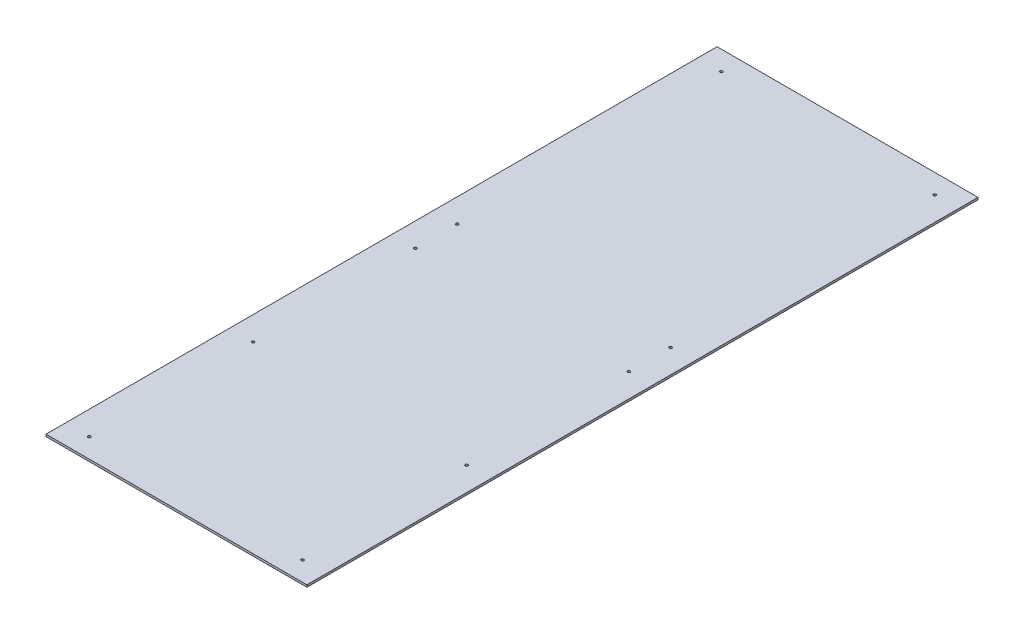
ISO-10303-21;
HEADER;
FILE_DESCRIPTION(('STEP AP214'),'2;1');
FILE_NAME('part.step','',(''),(''),'','','');
FILE_SCHEMA(('AUTOMOTIVE_DESIGN { 1 0 10303 214 1 1 1 1 }'));
ENDSEC;
DATA;
#1=APPLICATION_CONTEXT('core data for automotive mechanical design processes');
#2=APPLICATION_PROTOCOL_DEFINITION('international standard','automotive_design',2000,#1);
#3=PRODUCT_CONTEXT('',#1,'mechanical');
#4=PRODUCT('Part','Part','',(#3));
#5=PRODUCT_RELATED_PRODUCT_CATEGORY('part','',(#4));
#6=PRODUCT_DEFINITION_FORMATION('','',#4);
#7=PRODUCT_DEFINITION_CONTEXT('part definition',#1,'design');
#8=PRODUCT_DEFINITION('design','',#6,#7);
#9=PRODUCT_DEFINITION_SHAPE('','',#8);
#10=(LENGTH_UNIT() NAMED_UNIT(*) SI_UNIT(.MILLI.,.METRE.));
#11=(NAMED_UNIT(*) PLANE_ANGLE_UNIT() SI_UNIT($,.RADIAN.));
#12=(NAMED_UNIT(*) SI_UNIT($,.STERADIAN.) SOLID_ANGLE_UNIT());
#13=UNCERTAINTY_MEASURE_WITH_UNIT(LENGTH_MEASURE(1.E-05),#10,'distance_accuracy_value','');
#14=(GEOMETRIC_REPRESENTATION_CONTEXT(3) GLOBAL_UNCERTAINTY_ASSIGNED_CONTEXT((#13)) GLOBAL_UNIT_ASSIGNED_CONTEXT((#10,
#11,#12)) REPRESENTATION_CONTEXT('',''));
#15=CARTESIAN_POINT('',(0.,0.,0.));
#16=DIRECTION('',(0.,0.,1.));
#17=DIRECTION('',(1.,0.,0.));
#18=AXIS2_PLACEMENT_3D('',#15,#16,#17);
#19=CARTESIAN_POINT('',(-383.921,6.35,987.425));
#20=DIRECTION('',(1.,0.,0.));
#21=DIRECTION('',(0.,0.,-1.));
#22=AXIS2_PLACEMENT_3D('',#19,#20,#21);
#23=PLANE('',#22);
#24=DIRECTION('',(0.,0.,1.));
#25=VECTOR('',#24,1.);
#26=CARTESIAN_POINT('',(-383.921,0.,987.425));
#27=LINE('',#26,#25);
#28=CARTESIAN_POINT('',(-383.921,0.,-987.425));
#29=VERTEX_POINT('',#28);
#30=CARTESIAN_POINT('',(-383.921,0.,987.425));
#31=VERTEX_POINT('',#30);
#32=EDGE_CURVE('E97',#29,#31,#27,.T.);
#33=ORIENTED_EDGE('',*,*,#32,.T.);
#34=DIRECTION('',(0.,-1.,0.));
#35=VECTOR('',#34,1.);
#36=CARTESIAN_POINT('',(-383.921,6.35,987.425));
#37=LINE('',#36,#35);
#38=CARTESIAN_POINT('',(-383.921,6.35,987.425));
#39=VERTEX_POINT('',#38);
#40=EDGE_CURVE('E11',#39,#31,#37,.T.);
#41=ORIENTED_EDGE('',*,*,#40,.F.);
#42=DIRECTION('',(0.,0.,1.));
#43=VECTOR('',#42,1.);
#44=CARTESIAN_POINT('',(-383.921,6.35,987.425));
#45=LINE('',#44,#43);
#46=CARTESIAN_POINT('',(-383.921,6.35,-987.425));
#47=VERTEX_POINT('',#46);
#48=EDGE_CURVE('E85',#47,#39,#45,.T.);
#49=ORIENTED_EDGE('',*,*,#48,.F.);
#50=DIRECTION('',(0.,-1.,0.));
#51=VECTOR('',#50,1.);
#52=CARTESIAN_POINT('',(-383.921,6.35,-987.425));
#53=LINE('',#52,#51);
#54=EDGE_CURVE('E93',#47,#29,#53,.T.);
#55=ORIENTED_EDGE('',*,*,#54,.T.);
#56=EDGE_LOOP('',(#33,#41,#49,#55));
#57=FACE_BOUND('',#56,.T.);
#58=ADVANCED_FACE('F34',(#57),#23,.F.);
#59=CARTESIAN_POINT('',(383.921,6.35,987.425));
#60=DIRECTION('',(0.,0.,-1.));
#61=DIRECTION('',(-1.,0.,0.));
#62=AXIS2_PLACEMENT_3D('',#59,#60,#61);
#63=PLANE('',#62);
#64=DIRECTION('',(1.,0.,0.));
#65=VECTOR('',#64,1.);
#66=CARTESIAN_POINT('',(383.921,0.,987.425));
#67=LINE('',#66,#65);
#68=CARTESIAN_POINT('',(383.921,0.,987.425));
#69=VERTEX_POINT('',#68);
#70=EDGE_CURVE('E89',#31,#69,#67,.T.);
#71=ORIENTED_EDGE('',*,*,#70,.T.);
#72=DIRECTION('',(0.,-1.,0.));
#73=VECTOR('',#72,1.);
#74=CARTESIAN_POINT('',(383.921,6.35,987.425));
#75=LINE('',#74,#73);
#76=CARTESIAN_POINT('',(383.921,6.35,987.425));
#77=VERTEX_POINT('',#76);
#78=EDGE_CURVE('E42',#77,#69,#75,.T.);
#79=ORIENTED_EDGE('',*,*,#78,.F.);
#80=DIRECTION('',(1.,0.,0.));
#81=VECTOR('',#80,1.);
#82=CARTESIAN_POINT('',(383.921,6.35,987.425));
#83=LINE('',#82,#81);
#84=EDGE_CURVE('E80',#39,#77,#83,.T.);
#85=ORIENTED_EDGE('',*,*,#84,.F.);
#86=ORIENTED_EDGE('',*,*,#40,.T.);
#87=EDGE_LOOP('',(#71,#79,#85,#86));
#88=FACE_BOUND('',#87,.T.);
#89=ADVANCED_FACE('F88',(#88),#63,.F.);
#90=CARTESIAN_POINT('',(383.921,6.35,987.425));
#91=DIRECTION('',(-1.,0.,0.));
#92=DIRECTION('',(0.,0.,1.));
#93=AXIS2_PLACEMENT_3D('',#90,#91,#92);
#94=PLANE('',#93);
#95=DIRECTION('',(0.,0.,-1.));
#96=VECTOR('',#95,1.);
#97=CARTESIAN_POINT('',(383.921,0.,987.425));
#98=LINE('',#97,#96);
#99=CARTESIAN_POINT('',(383.921,0.,-987.425));
#100=VERTEX_POINT('',#99);
#101=EDGE_CURVE('E67',#69,#100,#98,.T.);
#102=ORIENTED_EDGE('',*,*,#101,.T.);
#103=DIRECTION('',(0.,-1.,0.));
#104=VECTOR('',#103,1.);
#105=CARTESIAN_POINT('',(383.921,6.35,-987.425));
#106=LINE('',#105,#104);
#107=CARTESIAN_POINT('',(383.921,6.35,-987.425));
#108=VERTEX_POINT('',#107);
#109=EDGE_CURVE('E90',#108,#100,#106,.T.);
#110=ORIENTED_EDGE('',*,*,#109,.F.);
#111=DIRECTION('',(0.,0.,-1.));
#112=VECTOR('',#111,1.);
#113=CARTESIAN_POINT('',(383.921,6.35,987.425));
#114=LINE('',#113,#112);
#115=EDGE_CURVE('E83',#77,#108,#114,.T.);
#116=ORIENTED_EDGE('',*,*,#115,.F.);
#117=ORIENTED_EDGE('',*,*,#78,.T.);
#118=EDGE_LOOP('',(#102,#110,#116,#117));
#119=FACE_BOUND('',#118,.T.);
#120=ADVANCED_FACE('F91',(#119),#94,.F.);
#121=CARTESIAN_POINT('',(383.921,6.35,-987.425));
#122=DIRECTION('',(0.,0.,1.));
#123=DIRECTION('',(1.,0.,0.));
#124=AXIS2_PLACEMENT_3D('',#121,#122,#123);
#125=PLANE('',#124);
#126=DIRECTION('',(-1.,0.,0.));
#127=VECTOR('',#126,1.);
#128=CARTESIAN_POINT('',(383.921,0.,-987.425));
#129=LINE('',#128,#127);
#130=EDGE_CURVE('E73',#100,#29,#129,.T.);
#131=ORIENTED_EDGE('',*,*,#130,.T.);
#132=ORIENTED_EDGE('',*,*,#54,.F.);
#133=DIRECTION('',(-1.,0.,0.));
#134=VECTOR('',#133,1.);
#135=CARTESIAN_POINT('',(383.921,6.35,-987.425));
#136=LINE('',#135,#134);
#137=EDGE_CURVE('E50',#108,#47,#136,.T.);
#138=ORIENTED_EDGE('',*,*,#137,.F.);
#139=ORIENTED_EDGE('',*,*,#109,.T.);
#140=EDGE_LOOP('',(#131,#132,#138,#139));
#141=FACE_BOUND('',#140,.T.);
#142=ADVANCED_FACE('F105',(#141),#125,.F.);
#143=CARTESIAN_POINT('',(0.,6.35,0.));
#144=DIRECTION('',(0.,1.,0.));
#145=DIRECTION('',(0.,0.,1.));
#146=AXIS2_PLACEMENT_3D('',#143,#144,#145);
#147=PLANE('',#146);
#148=CARTESIAN_POINT('',(314.070999999993,6.35,930.275));
#149=DIRECTION('',(0.,-1.,0.));
#150=DIRECTION('',(0.,0.,-1.));
#151=AXIS2_PLACEMENT_3D('',#148,#149,#150);
#152=CIRCLE('',#151,4.01319999999999);
#153=CARTESIAN_POINT('',(314.070999999993,6.35,926.2618));
#154=VERTEX_POINT('',#153);
#155=EDGE_CURVE('E164',#154,#154,#152,.T.);
#156=ORIENTED_EDGE('',*,*,#155,.T.);
#157=EDGE_LOOP('',(#156));
#158=FACE_BOUND('',#157,.T.);
#159=CARTESIAN_POINT('',(-313.944000000007,6.35,930.275));
#160=DIRECTION('',(0.,-1.,0.));
#161=DIRECTION('',(0.,0.,-1.));
#162=AXIS2_PLACEMENT_3D('',#159,#160,#161);
#163=CIRCLE('',#162,4.01319999999999);
#164=CARTESIAN_POINT('',(-313.944000000007,6.35,926.2618));
#165=VERTEX_POINT('',#164);
#166=EDGE_CURVE('E158',#165,#165,#163,.T.);
#167=ORIENTED_EDGE('',*,*,#166,.T.);
#168=EDGE_LOOP('',(#167));
#169=FACE_BOUND('',#168,.T.);
#170=CARTESIAN_POINT('',(314.070999999996,6.35,-29.6337387767919));
#171=DIRECTION('',(0.,-1.,0.));
#172=DIRECTION('',(0.,0.,-1.));
#173=AXIS2_PLACEMENT_3D('',#170,#171,#172);
#174=CIRCLE('',#173,4.01319999999999);
#175=CARTESIAN_POINT('',(314.070999999996,6.35,-33.6469387767919));
#176=VERTEX_POINT('',#175);
#177=EDGE_CURVE('E152',#176,#176,#174,.T.);
#178=ORIENTED_EDGE('',*,*,#177,.T.);
#179=EDGE_LOOP('',(#178));
#180=FACE_BOUND('',#179,.T.);
#181=CARTESIAN_POINT('',(-314.071,6.35,-29.6337387767919));
#182=DIRECTION('',(0.,-1.,0.));
#183=DIRECTION('',(0.,0.,-1.));
#184=AXIS2_PLACEMENT_3D('',#181,#182,#183);
#185=CIRCLE('',#184,4.01319999999999);
#186=CARTESIAN_POINT('',(-314.071,6.35,-33.6469387767919));
#187=VERTEX_POINT('',#186);
#188=EDGE_CURVE('E146',#187,#187,#185,.T.);
#189=ORIENTED_EDGE('',*,*,#188,.T.);
#190=EDGE_LOOP('',(#189));
#191=FACE_BOUND('',#190,.T.);
#192=CARTESIAN_POINT('',(-313.944,6.35,-930.275));
#193=DIRECTION('',(0.,-1.,0.));
#194=DIRECTION('',(0.,0.,-1.));
#195=AXIS2_PLACEMENT_3D('',#192,#193,#194);
#196=CIRCLE('',#195,4.01319999999999);
#197=CARTESIAN_POINT('',(-313.944,6.35,-934.2882));
#198=VERTEX_POINT('',#197);
#199=EDGE_CURVE('E140',#198,#198,#196,.T.);
#200=ORIENTED_EDGE('',*,*,#199,.T.);
#201=EDGE_LOOP('',(#200));
#202=FACE_BOUND('',#201,.T.);
#203=CARTESIAN_POINT('',(314.071,6.35,-930.275));
#204=DIRECTION('',(0.,-1.,0.));
#205=DIRECTION('',(0.,0.,-1.));
#206=AXIS2_PLACEMENT_3D('',#203,#204,#205);
#207=CIRCLE('',#206,4.01319999999999);
#208=CARTESIAN_POINT('',(314.071,6.35,-934.2882));
#209=VERTEX_POINT('',#208);
#210=EDGE_CURVE('E134',#209,#209,#207,.T.);
#211=ORIENTED_EDGE('',*,*,#210,.T.);
#212=EDGE_LOOP('',(#211));
#213=FACE_BOUND('',#212,.T.);
#214=CARTESIAN_POINT('',(314.071,6.35,-152.769407651758));
#215=DIRECTION('',(0.,-1.,0.));
#216=DIRECTION('',(0.,0.,-1.));
#217=AXIS2_PLACEMENT_3D('',#214,#215,#216);
#218=CIRCLE('',#217,4.01319999999999);
#219=CARTESIAN_POINT('',(314.071,6.35,-156.782607651758));
#220=VERTEX_POINT('',#219);
#221=EDGE_CURVE('E128',#220,#220,#218,.T.);
#222=ORIENTED_EDGE('',*,*,#221,.T.);
#223=EDGE_LOOP('',(#222));
#224=FACE_BOUND('',#223,.T.);
#225=CARTESIAN_POINT('',(-314.070999999996,6.35,-152.769407651758));
#226=DIRECTION('',(0.,-1.,0.));
#227=DIRECTION('',(0.,0.,-1.));
#228=AXIS2_PLACEMENT_3D('',#225,#226,#227);
#229=CIRCLE('',#228,4.01319999999999);
#230=CARTESIAN_POINT('',(-314.070999999996,6.35,-156.782607651758));
#231=VERTEX_POINT('',#230);
#232=EDGE_CURVE('E122',#231,#231,#229,.T.);
#233=ORIENTED_EDGE('',*,*,#232,.T.);
#234=EDGE_LOOP('',(#233));
#235=FACE_BOUND('',#234,.T.);
#236=CARTESIAN_POINT('',(314.070999999993,6.35,447.611159484925));
#237=DIRECTION('',(0.,-1.,0.));
#238=DIRECTION('',(0.,0.,-1.));
#239=AXIS2_PLACEMENT_3D('',#236,#237,#238);
#240=CIRCLE('',#239,4.01319999999999);
#241=CARTESIAN_POINT('',(314.070999999993,6.35,443.597959484925));
#242=VERTEX_POINT('',#241);
#243=EDGE_CURVE('E116',#242,#242,#240,.T.);
#244=ORIENTED_EDGE('',*,*,#243,.T.);
#245=EDGE_LOOP('',(#244));
#246=FACE_BOUND('',#245,.T.);
#247=CARTESIAN_POINT('',(-314.071,6.35,447.611159484925));
#248=DIRECTION('',(0.,-1.,0.));
#249=DIRECTION('',(0.,0.,-1.));
#250=AXIS2_PLACEMENT_3D('',#247,#248,#249);
#251=CIRCLE('',#250,4.01319999999999);
#252=CARTESIAN_POINT('',(-314.071,6.35,443.597959484925));
#253=VERTEX_POINT('',#252);
#254=EDGE_CURVE('E100',#253,#253,#251,.T.);
#255=ORIENTED_EDGE('',*,*,#254,.T.);
#256=EDGE_LOOP('',(#255));
#257=FACE_BOUND('',#256,.T.);
#258=ORIENTED_EDGE('',*,*,#48,.T.);
#259=ORIENTED_EDGE('',*,*,#84,.T.);
#260=ORIENTED_EDGE('',*,*,#115,.T.);
#261=ORIENTED_EDGE('',*,*,#137,.T.);
#262=EDGE_LOOP('',(#258,#259,#260,#261));
#263=FACE_BOUND('',#262,.T.);
#264=ADVANCED_FACE('F81',(#158,#169,#180,#191,#202,#213,#224,#235,#246,#257,#263),#147,.T.);
#265=CARTESIAN_POINT('',(0.,0.,0.));
#266=DIRECTION('',(0.,1.,0.));
#267=DIRECTION('',(0.,0.,1.));
#268=AXIS2_PLACEMENT_3D('',#265,#266,#267);
#269=PLANE('',#268);
#270=CARTESIAN_POINT('',(314.070999999993,0.,930.275));
#271=DIRECTION('',(0.,-1.,0.));
#272=DIRECTION('',(0.,0.,-1.));
#273=AXIS2_PLACEMENT_3D('',#270,#271,#272);
#274=CIRCLE('',#273,4.01319999999999);
#275=CARTESIAN_POINT('',(314.070999999993,0.,926.2618));
#276=VERTEX_POINT('',#275);
#277=EDGE_CURVE('E167',#276,#276,#274,.T.);
#278=ORIENTED_EDGE('',*,*,#277,.F.);
#279=EDGE_LOOP('',(#278));
#280=FACE_BOUND('',#279,.T.);
#281=CARTESIAN_POINT('',(-313.944000000007,0.,930.275));
#282=DIRECTION('',(0.,-1.,0.));
#283=DIRECTION('',(0.,0.,-1.));
#284=AXIS2_PLACEMENT_3D('',#281,#282,#283);
#285=CIRCLE('',#284,4.01319999999999);
#286=CARTESIAN_POINT('',(-313.944000000007,0.,926.2618));
#287=VERTEX_POINT('',#286);
#288=EDGE_CURVE('E161',#287,#287,#285,.T.);
#289=ORIENTED_EDGE('',*,*,#288,.F.);
#290=EDGE_LOOP('',(#289));
#291=FACE_BOUND('',#290,.T.);
#292=CARTESIAN_POINT('',(314.070999999996,0.,-29.6337387767919));
#293=DIRECTION('',(0.,-1.,0.));
#294=DIRECTION('',(0.,0.,-1.));
#295=AXIS2_PLACEMENT_3D('',#292,#293,#294);
#296=CIRCLE('',#295,4.01319999999999);
#297=CARTESIAN_POINT('',(314.070999999996,0.,-33.6469387767919));
#298=VERTEX_POINT('',#297);
#299=EDGE_CURVE('E155',#298,#298,#296,.T.);
#300=ORIENTED_EDGE('',*,*,#299,.F.);
#301=EDGE_LOOP('',(#300));
#302=FACE_BOUND('',#301,.T.);
#303=CARTESIAN_POINT('',(-314.071,0.,-29.6337387767919));
#304=DIRECTION('',(0.,-1.,0.));
#305=DIRECTION('',(0.,0.,-1.));
#306=AXIS2_PLACEMENT_3D('',#303,#304,#305);
#307=CIRCLE('',#306,4.01319999999999);
#308=CARTESIAN_POINT('',(-314.071,0.,-33.6469387767919));
#309=VERTEX_POINT('',#308);
#310=EDGE_CURVE('E149',#309,#309,#307,.T.);
#311=ORIENTED_EDGE('',*,*,#310,.F.);
#312=EDGE_LOOP('',(#311));
#313=FACE_BOUND('',#312,.T.);
#314=CARTESIAN_POINT('',(-313.944,0.,-930.275));
#315=DIRECTION('',(0.,-1.,0.));
#316=DIRECTION('',(0.,0.,-1.));
#317=AXIS2_PLACEMENT_3D('',#314,#315,#316);
#318=CIRCLE('',#317,4.01319999999999);
#319=CARTESIAN_POINT('',(-313.944,0.,-934.2882));
#320=VERTEX_POINT('',#319);
#321=EDGE_CURVE('E143',#320,#320,#318,.T.);
#322=ORIENTED_EDGE('',*,*,#321,.F.);
#323=EDGE_LOOP('',(#322));
#324=FACE_BOUND('',#323,.T.);
#325=CARTESIAN_POINT('',(314.071,0.,-930.275));
#326=DIRECTION('',(0.,-1.,0.));
#327=DIRECTION('',(0.,0.,-1.));
#328=AXIS2_PLACEMENT_3D('',#325,#326,#327);
#329=CIRCLE('',#328,4.01319999999999);
#330=CARTESIAN_POINT('',(314.071,0.,-934.2882));
#331=VERTEX_POINT('',#330);
#332=EDGE_CURVE('E137',#331,#331,#329,.T.);
#333=ORIENTED_EDGE('',*,*,#332,.F.);
#334=EDGE_LOOP('',(#333));
#335=FACE_BOUND('',#334,.T.);
#336=CARTESIAN_POINT('',(314.071,0.,-152.769407651758));
#337=DIRECTION('',(0.,-1.,0.));
#338=DIRECTION('',(0.,0.,-1.));
#339=AXIS2_PLACEMENT_3D('',#336,#337,#338);
#340=CIRCLE('',#339,4.01319999999999);
#341=CARTESIAN_POINT('',(314.071,0.,-156.782607651758));
#342=VERTEX_POINT('',#341);
#343=EDGE_CURVE('E131',#342,#342,#340,.T.);
#344=ORIENTED_EDGE('',*,*,#343,.F.);
#345=EDGE_LOOP('',(#344));
#346=FACE_BOUND('',#345,.T.);
#347=CARTESIAN_POINT('',(-314.070999999996,0.,-152.769407651758));
#348=DIRECTION('',(0.,-1.,0.));
#349=DIRECTION('',(0.,0.,-1.));
#350=AXIS2_PLACEMENT_3D('',#347,#348,#349);
#351=CIRCLE('',#350,4.01319999999999);
#352=CARTESIAN_POINT('',(-314.070999999996,0.,-156.782607651758));
#353=VERTEX_POINT('',#352);
#354=EDGE_CURVE('E125',#353,#353,#351,.T.);
#355=ORIENTED_EDGE('',*,*,#354,.F.);
#356=EDGE_LOOP('',(#355));
#357=FACE_BOUND('',#356,.T.);
#358=CARTESIAN_POINT('',(314.070999999993,0.,447.611159484925));
#359=DIRECTION('',(0.,-1.,0.));
#360=DIRECTION('',(0.,0.,-1.));
#361=AXIS2_PLACEMENT_3D('',#358,#359,#360);
#362=CIRCLE('',#361,4.01319999999999);
#363=CARTESIAN_POINT('',(314.070999999993,0.,443.597959484925));
#364=VERTEX_POINT('',#363);
#365=EDGE_CURVE('E119',#364,#364,#362,.T.);
#366=ORIENTED_EDGE('',*,*,#365,.F.);
#367=EDGE_LOOP('',(#366));
#368=FACE_BOUND('',#367,.T.);
#369=CARTESIAN_POINT('',(-314.071,0.,447.611159484925));
#370=DIRECTION('',(0.,-1.,0.));
#371=DIRECTION('',(0.,0.,-1.));
#372=AXIS2_PLACEMENT_3D('',#369,#370,#371);
#373=CIRCLE('',#372,4.01319999999999);
#374=CARTESIAN_POINT('',(-314.071,0.,443.597959484925));
#375=VERTEX_POINT('',#374);
#376=EDGE_CURVE('E113',#375,#375,#373,.T.);
#377=ORIENTED_EDGE('',*,*,#376,.F.);
#378=EDGE_LOOP('',(#377));
#379=FACE_BOUND('',#378,.T.);
#380=ORIENTED_EDGE('',*,*,#32,.F.);
#381=ORIENTED_EDGE('',*,*,#130,.F.);
#382=ORIENTED_EDGE('',*,*,#101,.F.);
#383=ORIENTED_EDGE('',*,*,#70,.F.);
#384=EDGE_LOOP('',(#380,#381,#382,#383));
#385=FACE_BOUND('',#384,.T.);
#386=ADVANCED_FACE('F108',(#280,#291,#302,#313,#324,#335,#346,#357,#368,#379,#385),#269,.F.);
#387=CARTESIAN_POINT('',(-314.071,0.,447.611159484925));
#388=DIRECTION('',(0.,-1.,0.));
#389=DIRECTION('',(0.,0.,-1.));
#390=AXIS2_PLACEMENT_3D('',#387,#388,#389);
#391=CYLINDRICAL_SURFACE('',#390,4.01319999999999);
#392=ORIENTED_EDGE('',*,*,#254,.F.);
#393=EDGE_LOOP('',(#392));
#394=FACE_BOUND('',#393,.T.);
#395=ORIENTED_EDGE('',*,*,#376,.T.);
#396=EDGE_LOOP('',(#395));
#397=FACE_BOUND('',#396,.T.);
#398=ADVANCED_FACE('F175',(#394,#397),#391,.F.);
#399=CARTESIAN_POINT('',(314.070999999993,0.,447.611159484925));
#400=DIRECTION('',(0.,-1.,0.));
#401=DIRECTION('',(0.,0.,-1.));
#402=AXIS2_PLACEMENT_3D('',#399,#400,#401);
#403=CYLINDRICAL_SURFACE('',#402,4.01319999999999);
#404=ORIENTED_EDGE('',*,*,#243,.F.);
#405=EDGE_LOOP('',(#404));
#406=FACE_BOUND('',#405,.T.);
#407=ORIENTED_EDGE('',*,*,#365,.T.);
#408=EDGE_LOOP('',(#407));
#409=FACE_BOUND('',#408,.T.);
#410=ADVANCED_FACE('F196',(#406,#409),#403,.F.);
#411=CARTESIAN_POINT('',(-314.070999999996,0.,-152.769407651758));
#412=DIRECTION('',(0.,-1.,0.));
#413=DIRECTION('',(0.,0.,-1.));
#414=AXIS2_PLACEMENT_3D('',#411,#412,#413);
#415=CYLINDRICAL_SURFACE('',#414,4.01319999999999);
#416=ORIENTED_EDGE('',*,*,#232,.F.);
#417=EDGE_LOOP('',(#416));
#418=FACE_BOUND('',#417,.T.);
#419=ORIENTED_EDGE('',*,*,#354,.T.);
#420=EDGE_LOOP('',(#419));
#421=FACE_BOUND('',#420,.T.);
#422=ADVANCED_FACE('F202',(#418,#421),#415,.F.);
#423=CARTESIAN_POINT('',(314.071,0.,-152.769407651758));
#424=DIRECTION('',(0.,-1.,0.));
#425=DIRECTION('',(0.,0.,-1.));
#426=AXIS2_PLACEMENT_3D('',#423,#424,#425);
#427=CYLINDRICAL_SURFACE('',#426,4.01319999999999);
#428=ORIENTED_EDGE('',*,*,#221,.F.);
#429=EDGE_LOOP('',(#428));
#430=FACE_BOUND('',#429,.T.);
#431=ORIENTED_EDGE('',*,*,#343,.T.);
#432=EDGE_LOOP('',(#431));
#433=FACE_BOUND('',#432,.T.);
#434=ADVANCED_FACE('F243',(#430,#433),#427,.F.);
#435=CARTESIAN_POINT('',(314.071,0.,-930.275));
#436=DIRECTION('',(0.,-1.,0.));
#437=DIRECTION('',(0.,0.,-1.));
#438=AXIS2_PLACEMENT_3D('',#435,#436,#437);
#439=CYLINDRICAL_SURFACE('',#438,4.01319999999999);
#440=ORIENTED_EDGE('',*,*,#210,.F.);
#441=EDGE_LOOP('',(#440));
#442=FACE_BOUND('',#441,.T.);
#443=ORIENTED_EDGE('',*,*,#332,.T.);
#444=EDGE_LOOP('',(#443));
#445=FACE_BOUND('',#444,.T.);
#446=ADVANCED_FACE('F248',(#442,#445),#439,.F.);
#447=CARTESIAN_POINT('',(-313.944,0.,-930.275));
#448=DIRECTION('',(0.,-1.,0.));
#449=DIRECTION('',(0.,0.,-1.));
#450=AXIS2_PLACEMENT_3D('',#447,#448,#449);
#451=CYLINDRICAL_SURFACE('',#450,4.01319999999999);
#452=ORIENTED_EDGE('',*,*,#199,.F.);
#453=EDGE_LOOP('',(#452));
#454=FACE_BOUND('',#453,.T.);
#455=ORIENTED_EDGE('',*,*,#321,.T.);
#456=EDGE_LOOP('',(#455));
#457=FACE_BOUND('',#456,.T.);
#458=ADVANCED_FACE('F254',(#454,#457),#451,.F.);
#459=CARTESIAN_POINT('',(-314.071,0.,-29.6337387767919));
#460=DIRECTION('',(0.,-1.,0.));
#461=DIRECTION('',(0.,0.,-1.));
#462=AXIS2_PLACEMENT_3D('',#459,#460,#461);
#463=CYLINDRICAL_SURFACE('',#462,4.01319999999999);
#464=ORIENTED_EDGE('',*,*,#188,.F.);
#465=EDGE_LOOP('',(#464));
#466=FACE_BOUND('',#465,.T.);
#467=ORIENTED_EDGE('',*,*,#310,.T.);
#468=EDGE_LOOP('',(#467));
#469=FACE_BOUND('',#468,.T.);
#470=ADVANCED_FACE('F258',(#466,#469),#463,.F.);
#471=CARTESIAN_POINT('',(314.070999999996,0.,-29.6337387767919));
#472=DIRECTION('',(0.,-1.,0.));
#473=DIRECTION('',(0.,0.,-1.));
#474=AXIS2_PLACEMENT_3D('',#471,#472,#473);
#475=CYLINDRICAL_SURFACE('',#474,4.01319999999999);
#476=ORIENTED_EDGE('',*,*,#177,.F.);
#477=EDGE_LOOP('',(#476));
#478=FACE_BOUND('',#477,.T.);
#479=ORIENTED_EDGE('',*,*,#299,.T.);
#480=EDGE_LOOP('',(#479));
#481=FACE_BOUND('',#480,.T.);
#482=ADVANCED_FACE('F262',(#478,#481),#475,.F.);
#483=CARTESIAN_POINT('',(-313.944000000007,0.,930.275));
#484=DIRECTION('',(0.,-1.,0.));
#485=DIRECTION('',(0.,0.,-1.));
#486=AXIS2_PLACEMENT_3D('',#483,#484,#485);
#487=CYLINDRICAL_SURFACE('',#486,4.01319999999999);
#488=ORIENTED_EDGE('',*,*,#166,.F.);
#489=EDGE_LOOP('',(#488));
#490=FACE_BOUND('',#489,.T.);
#491=ORIENTED_EDGE('',*,*,#288,.T.);
#492=EDGE_LOOP('',(#491));
#493=FACE_BOUND('',#492,.T.);
#494=ADVANCED_FACE('F266',(#490,#493),#487,.F.);
#495=CARTESIAN_POINT('',(314.070999999993,0.,930.275));
#496=DIRECTION('',(0.,-1.,0.));
#497=DIRECTION('',(0.,0.,-1.));
#498=AXIS2_PLACEMENT_3D('',#495,#496,#497);
#499=CYLINDRICAL_SURFACE('',#498,4.01319999999999);
#500=ORIENTED_EDGE('',*,*,#155,.F.);
#501=EDGE_LOOP('',(#500));
#502=FACE_BOUND('',#501,.T.);
#503=ORIENTED_EDGE('',*,*,#277,.T.);
#504=EDGE_LOOP('',(#503));
#505=FACE_BOUND('',#504,.T.);
#506=ADVANCED_FACE('F171',(#502,#505),#499,.F.);
#507=CLOSED_SHELL('',(#58,#89,#120,#142,#264,#386,#398,#410,#422,#434,#446,#458,#470,#482,#494,#506));
#508=MANIFOLD_SOLID_BREP('B2',#507);
#509=ADVANCED_BREP_SHAPE_REPRESENTATION('',(#18,#508),#14);
#510=SHAPE_DEFINITION_REPRESENTATION(#9,#509);
ENDSEC;
END-ISO-10303-21;
